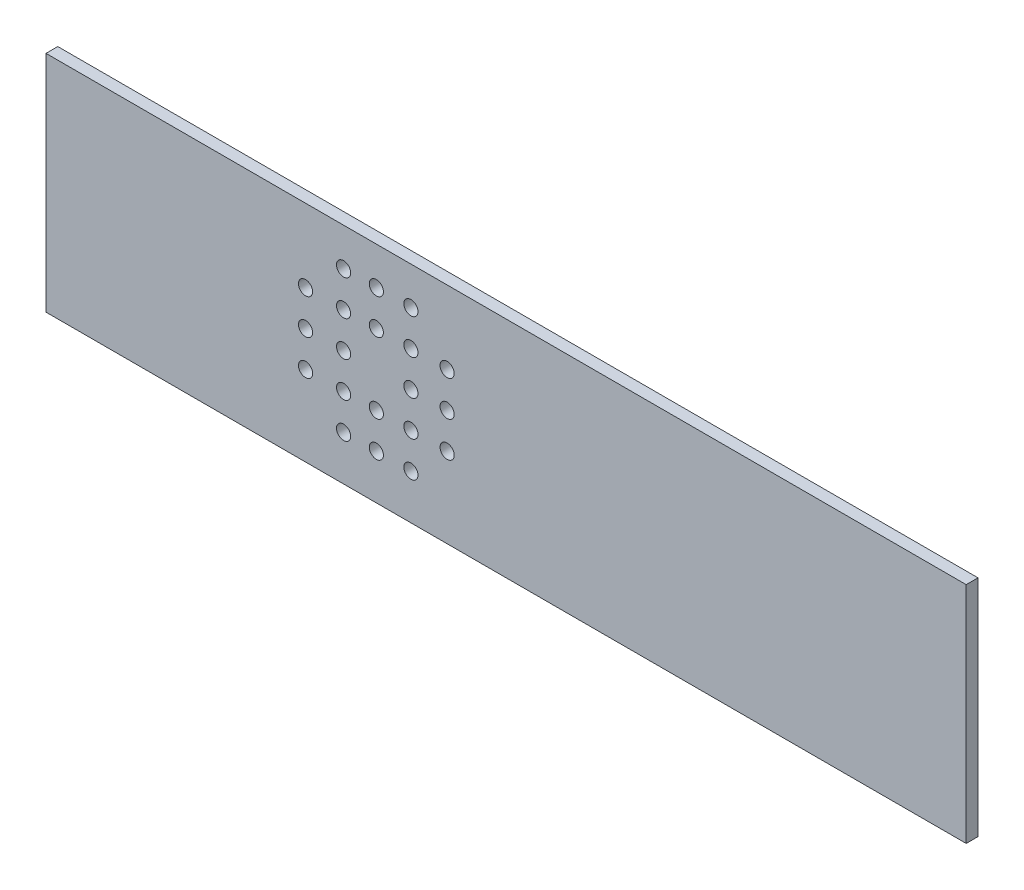
ISO-10303-21;
HEADER;
FILE_DESCRIPTION(('STEP AP214'),'2;1');
FILE_NAME('part.step','',(''),(''),'','','');
FILE_SCHEMA(('AUTOMOTIVE_DESIGN { 1 0 10303 214 1 1 1 1 }'));
ENDSEC;
DATA;
#1=APPLICATION_CONTEXT('core data for automotive mechanical design processes');
#2=APPLICATION_PROTOCOL_DEFINITION('international standard','automotive_design',2000,#1);
#3=PRODUCT_CONTEXT('',#1,'mechanical');
#4=PRODUCT('Part','Part','',(#3));
#5=PRODUCT_RELATED_PRODUCT_CATEGORY('part','',(#4));
#6=PRODUCT_DEFINITION_FORMATION('','',#4);
#7=PRODUCT_DEFINITION_CONTEXT('part definition',#1,'design');
#8=PRODUCT_DEFINITION('design','',#6,#7);
#9=PRODUCT_DEFINITION_SHAPE('','',#8);
#10=(LENGTH_UNIT() NAMED_UNIT(*) SI_UNIT(.MILLI.,.METRE.));
#11=(NAMED_UNIT(*) PLANE_ANGLE_UNIT() SI_UNIT($,.RADIAN.));
#12=(NAMED_UNIT(*) SI_UNIT($,.STERADIAN.) SOLID_ANGLE_UNIT());
#13=UNCERTAINTY_MEASURE_WITH_UNIT(LENGTH_MEASURE(1.E-05),#10,'distance_accuracy_value','');
#14=(GEOMETRIC_REPRESENTATION_CONTEXT(3) GLOBAL_UNCERTAINTY_ASSIGNED_CONTEXT((#13)) GLOBAL_UNIT_ASSIGNED_CONTEXT((#10,
#11,#12)) REPRESENTATION_CONTEXT('',''));
#15=CARTESIAN_POINT('',(0.,0.,0.));
#16=DIRECTION('',(0.,0.,1.));
#17=DIRECTION('',(1.,0.,0.));
#18=AXIS2_PLACEMENT_3D('',#15,#16,#17);
#19=CARTESIAN_POINT('',(0.,0.,5.));
#20=DIRECTION('',(0.,0.,1.));
#21=DIRECTION('',(1.,0.,0.));
#22=AXIS2_PLACEMENT_3D('',#19,#20,#21);
#23=PLANE('',#22);
#24=CARTESIAN_POINT('',(92.1890894196573,-22.2407910927372,5.));
#25=DIRECTION('',(0.,0.,1.));
#26=DIRECTION('',(1.,0.,0.));
#27=AXIS2_PLACEMENT_3D('',#24,#25,#26);
#28=CIRCLE('',#27,2.99999999999999);
#29=CARTESIAN_POINT('',(95.1890894196573,-22.2407910927372,5.));
#30=VERTEX_POINT('',#29);
#31=EDGE_CURVE('E217',#30,#30,#28,.T.);
#32=ORIENTED_EDGE('',*,*,#31,.F.);
#33=EDGE_LOOP('',(#32));
#34=FACE_BOUND('',#33,.T.);
#35=CARTESIAN_POINT('',(108.306752513581,-67.2407910927372,5.));
#36=DIRECTION('',(0.,0.,1.));
#37=DIRECTION('',(1.,0.,0.));
#38=AXIS2_PLACEMENT_3D('',#35,#36,#37);
#39=CIRCLE('',#38,2.99999999999999);
#40=CARTESIAN_POINT('',(111.306752513581,-67.2407910927372,5.));
#41=VERTEX_POINT('',#40);
#42=EDGE_CURVE('E205',#41,#41,#39,.T.);
#43=ORIENTED_EDGE('',*,*,#42,.F.);
#44=EDGE_LOOP('',(#43));
#45=FACE_BOUND('',#44,.T.);
#46=CARTESIAN_POINT('',(152.189089419657,-52.2407910927372,5.));
#47=DIRECTION('',(0.,0.,1.));
#48=DIRECTION('',(1.,0.,0.));
#49=AXIS2_PLACEMENT_3D('',#46,#47,#48);
#50=CIRCLE('',#49,2.99999999999999);
#51=CARTESIAN_POINT('',(155.189089419657,-52.2407910927372,5.));
#52=VERTEX_POINT('',#51);
#53=EDGE_CURVE('E193',#52,#52,#50,.T.);
#54=ORIENTED_EDGE('',*,*,#53,.F.);
#55=EDGE_LOOP('',(#54));
#56=FACE_BOUND('',#55,.T.);
#57=CARTESIAN_POINT('',(152.189089419657,-22.2407910927372,5.));
#58=DIRECTION('',(0.,0.,1.));
#59=DIRECTION('',(1.,0.,0.));
#60=AXIS2_PLACEMENT_3D('',#57,#58,#59);
#61=CIRCLE('',#60,2.99999999999999);
#62=CARTESIAN_POINT('',(155.189089419657,-22.2407910927372,5.));
#63=VERTEX_POINT('',#62);
#64=EDGE_CURVE('E181',#63,#63,#61,.T.);
#65=ORIENTED_EDGE('',*,*,#64,.F.);
#66=EDGE_LOOP('',(#65));
#67=FACE_BOUND('',#66,.T.);
#68=CARTESIAN_POINT('',(136.844623790647,-22.2407910927372,5.));
#69=DIRECTION('',(0.,0.,1.));
#70=DIRECTION('',(1.,0.,0.));
#71=AXIS2_PLACEMENT_3D('',#68,#69,#70);
#72=CIRCLE('',#71,2.99999999999999);
#73=CARTESIAN_POINT('',(139.844623790647,-22.2407910927372,5.));
#74=VERTEX_POINT('',#73);
#75=EDGE_CURVE('E169',#74,#74,#72,.T.);
#76=ORIENTED_EDGE('',*,*,#75,.F.);
#77=EDGE_LOOP('',(#76));
#78=FACE_BOUND('',#77,.T.);
#79=CARTESIAN_POINT('',(136.844623790647,-52.2407910927372,5.));
#80=DIRECTION('',(0.,0.,1.));
#81=DIRECTION('',(1.,0.,0.));
#82=AXIS2_PLACEMENT_3D('',#79,#80,#81);
#83=CIRCLE('',#82,2.99999999999999);
#84=CARTESIAN_POINT('',(139.844623790647,-52.2407910927372,5.));
#85=VERTEX_POINT('',#84);
#86=EDGE_CURVE('E157',#85,#85,#83,.T.);
#87=ORIENTED_EDGE('',*,*,#86,.F.);
#88=EDGE_LOOP('',(#87));
#89=FACE_BOUND('',#88,.T.);
#90=CARTESIAN_POINT('',(136.844623790647,-37.2407910927372,5.));
#91=DIRECTION('',(0.,0.,1.));
#92=DIRECTION('',(1.,0.,0.));
#93=AXIS2_PLACEMENT_3D('',#90,#91,#92);
#94=CIRCLE('',#93,2.99999999999999);
#95=CARTESIAN_POINT('',(139.844623790647,-37.2407910927372,5.));
#96=VERTEX_POINT('',#95);
#97=EDGE_CURVE('E145',#96,#96,#94,.T.);
#98=ORIENTED_EDGE('',*,*,#97,.F.);
#99=EDGE_LOOP('',(#98));
#100=FACE_BOUND('',#99,.T.);
#101=CARTESIAN_POINT('',(122.189089419657,-67.2407910927372,5.));
#102=DIRECTION('',(0.,0.,1.));
#103=DIRECTION('',(1.,0.,0.));
#104=AXIS2_PLACEMENT_3D('',#101,#102,#103);
#105=CIRCLE('',#104,2.99999999999999);
#106=CARTESIAN_POINT('',(125.189089419657,-67.2407910927372,5.));
#107=VERTEX_POINT('',#106);
#108=EDGE_CURVE('E133',#107,#107,#105,.T.);
#109=ORIENTED_EDGE('',*,*,#108,.F.);
#110=EDGE_LOOP('',(#109));
#111=FACE_BOUND('',#110,.T.);
#112=CARTESIAN_POINT('',(108.306752513581,-37.2407910927372,5.));
#113=DIRECTION('',(0.,0.,1.));
#114=DIRECTION('',(1.,0.,0.));
#115=AXIS2_PLACEMENT_3D('',#112,#113,#114);
#116=CIRCLE('',#115,3.00000000000001);
#117=CARTESIAN_POINT('',(111.306752513581,-37.2407910927372,5.));
#118=VERTEX_POINT('',#117);
#119=EDGE_CURVE('E121',#118,#118,#116,.T.);
#120=ORIENTED_EDGE('',*,*,#119,.F.);
#121=EDGE_LOOP('',(#120));
#122=FACE_BOUND('',#121,.T.);
#123=CARTESIAN_POINT('',(92.1890894196573,-37.2407910927372,5.));
#124=DIRECTION('',(0.,0.,1.));
#125=DIRECTION('',(1.,0.,0.));
#126=AXIS2_PLACEMENT_3D('',#123,#124,#125);
#127=CIRCLE('',#126,3.00000000000001);
#128=CARTESIAN_POINT('',(95.1890894196573,-37.2407910927372,5.));
#129=VERTEX_POINT('',#128);
#130=EDGE_CURVE('E100',#129,#129,#127,.T.);
#131=ORIENTED_EDGE('',*,*,#130,.F.);
#132=EDGE_LOOP('',(#131));
#133=FACE_BOUND('',#132,.T.);
#134=DIRECTION('',(0.,-1.,0.));
#135=VECTOR('',#134,1.);
#136=CARTESIAN_POINT('',(-17.8109105803427,8.77698574338086,5.));
#137=LINE('',#136,#135);
#138=CARTESIAN_POINT('',(-17.8109105803427,8.77698574338086,5.));
#139=VERTEX_POINT('',#138);
#140=CARTESIAN_POINT('',(-17.8109105803427,-86.2230142566191,5.));
#141=VERTEX_POINT('',#140);
#142=EDGE_CURVE('E85',#139,#141,#137,.T.);
#143=ORIENTED_EDGE('',*,*,#142,.T.);
#144=DIRECTION('',(1.,0.,0.));
#145=VECTOR('',#144,1.);
#146=CARTESIAN_POINT('',(-17.8109105803427,-86.2230142566191,5.));
#147=LINE('',#146,#145);
#148=CARTESIAN_POINT('',(372.189089419657,-86.2230142566191,5.));
#149=VERTEX_POINT('',#148);
#150=EDGE_CURVE('E80',#141,#149,#147,.T.);
#151=ORIENTED_EDGE('',*,*,#150,.T.);
#152=DIRECTION('',(0.,1.,0.));
#153=VECTOR('',#152,1.);
#154=CARTESIAN_POINT('',(372.189089419657,8.77698574338086,5.));
#155=LINE('',#154,#153);
#156=CARTESIAN_POINT('',(372.189089419657,8.77698574338086,5.));
#157=VERTEX_POINT('',#156);
#158=EDGE_CURVE('E83',#149,#157,#155,.T.);
#159=ORIENTED_EDGE('',*,*,#158,.T.);
#160=DIRECTION('',(-1.,0.,0.));
#161=VECTOR('',#160,1.);
#162=CARTESIAN_POINT('',(-17.8109105803427,8.77698574338086,5.));
#163=LINE('',#162,#161);
#164=EDGE_CURVE('E50',#157,#139,#163,.T.);
#165=ORIENTED_EDGE('',*,*,#164,.T.);
#166=EDGE_LOOP('',(#143,#151,#159,#165));
#167=FACE_BOUND('',#166,.T.);
#168=CARTESIAN_POINT('',(152.189089419657,-37.2407910927372,5.));
#169=DIRECTION('',(0.,0.,1.));
#170=DIRECTION('',(1.,0.,0.));
#171=AXIS2_PLACEMENT_3D('',#168,#169,#170);
#172=CIRCLE('',#171,2.99999999999999);
#173=CARTESIAN_POINT('',(155.189089419657,-37.2407910927372,5.));
#174=VERTEX_POINT('',#173);
#175=EDGE_CURVE('E115',#174,#174,#172,.T.);
#176=ORIENTED_EDGE('',*,*,#175,.F.);
#177=EDGE_LOOP('',(#176));
#178=FACE_BOUND('',#177,.T.);
#179=CARTESIAN_POINT('',(122.189089419657,-7.24079109273723,5.));
#180=DIRECTION('',(0.,0.,1.));
#181=DIRECTION('',(1.,0.,0.));
#182=AXIS2_PLACEMENT_3D('',#179,#180,#181);
#183=CIRCLE('',#182,2.99999999999999);
#184=CARTESIAN_POINT('',(125.189089419657,-7.24079109273723,5.));
#185=VERTEX_POINT('',#184);
#186=EDGE_CURVE('E127',#185,#185,#183,.T.);
#187=ORIENTED_EDGE('',*,*,#186,.F.);
#188=EDGE_LOOP('',(#187));
#189=FACE_BOUND('',#188,.T.);
#190=CARTESIAN_POINT('',(122.189089419657,-52.2407910927372,5.));
#191=DIRECTION('',(0.,0.,1.));
#192=DIRECTION('',(1.,0.,0.));
#193=AXIS2_PLACEMENT_3D('',#190,#191,#192);
#194=CIRCLE('',#193,2.99999999999997);
#195=CARTESIAN_POINT('',(125.189089419657,-52.2407910927372,5.));
#196=VERTEX_POINT('',#195);
#197=EDGE_CURVE('E139',#196,#196,#194,.T.);
#198=ORIENTED_EDGE('',*,*,#197,.F.);
#199=EDGE_LOOP('',(#198));
#200=FACE_BOUND('',#199,.T.);
#201=CARTESIAN_POINT('',(122.189089419657,-22.2407910927372,5.));
#202=DIRECTION('',(0.,0.,1.));
#203=DIRECTION('',(1.,0.,0.));
#204=AXIS2_PLACEMENT_3D('',#201,#202,#203);
#205=CIRCLE('',#204,2.99999999999999);
#206=CARTESIAN_POINT('',(125.189089419657,-22.2407910927372,5.));
#207=VERTEX_POINT('',#206);
#208=EDGE_CURVE('E151',#207,#207,#205,.T.);
#209=ORIENTED_EDGE('',*,*,#208,.F.);
#210=EDGE_LOOP('',(#209));
#211=FACE_BOUND('',#210,.T.);
#212=CARTESIAN_POINT('',(108.306752513581,-52.2407910927372,5.));
#213=DIRECTION('',(0.,0.,1.));
#214=DIRECTION('',(1.,0.,0.));
#215=AXIS2_PLACEMENT_3D('',#212,#213,#214);
#216=CIRCLE('',#215,2.99999999999999);
#217=CARTESIAN_POINT('',(111.306752513581,-52.2407910927372,5.));
#218=VERTEX_POINT('',#217);
#219=EDGE_CURVE('E163',#218,#218,#216,.T.);
#220=ORIENTED_EDGE('',*,*,#219,.F.);
#221=EDGE_LOOP('',(#220));
#222=FACE_BOUND('',#221,.T.);
#223=CARTESIAN_POINT('',(108.306752513581,-22.2407910927372,5.));
#224=DIRECTION('',(0.,0.,1.));
#225=DIRECTION('',(1.,0.,0.));
#226=AXIS2_PLACEMENT_3D('',#223,#224,#225);
#227=CIRCLE('',#226,2.99999999999999);
#228=CARTESIAN_POINT('',(111.306752513581,-22.2407910927372,5.));
#229=VERTEX_POINT('',#228);
#230=EDGE_CURVE('E175',#229,#229,#227,.T.);
#231=ORIENTED_EDGE('',*,*,#230,.F.);
#232=EDGE_LOOP('',(#231));
#233=FACE_BOUND('',#232,.T.);
#234=CARTESIAN_POINT('',(136.844623790647,-7.24079109273723,5.));
#235=DIRECTION('',(0.,0.,1.));
#236=DIRECTION('',(1.,0.,0.));
#237=AXIS2_PLACEMENT_3D('',#234,#235,#236);
#238=CIRCLE('',#237,2.99999999999999);
#239=CARTESIAN_POINT('',(139.844623790647,-7.24079109273723,5.));
#240=VERTEX_POINT('',#239);
#241=EDGE_CURVE('E187',#240,#240,#238,.T.);
#242=ORIENTED_EDGE('',*,*,#241,.F.);
#243=EDGE_LOOP('',(#242));
#244=FACE_BOUND('',#243,.T.);
#245=CARTESIAN_POINT('',(136.844623790647,-67.2407910927372,5.));
#246=DIRECTION('',(0.,0.,1.));
#247=DIRECTION('',(1.,0.,0.));
#248=AXIS2_PLACEMENT_3D('',#245,#246,#247);
#249=CIRCLE('',#248,2.99999999999999);
#250=CARTESIAN_POINT('',(139.844623790647,-67.2407910927372,5.));
#251=VERTEX_POINT('',#250);
#252=EDGE_CURVE('E199',#251,#251,#249,.T.);
#253=ORIENTED_EDGE('',*,*,#252,.F.);
#254=EDGE_LOOP('',(#253));
#255=FACE_BOUND('',#254,.T.);
#256=CARTESIAN_POINT('',(92.1890894196573,-52.2407910927372,5.));
#257=DIRECTION('',(0.,0.,1.));
#258=DIRECTION('',(1.,0.,0.));
#259=AXIS2_PLACEMENT_3D('',#256,#257,#258);
#260=CIRCLE('',#259,2.99999999999999);
#261=CARTESIAN_POINT('',(95.1890894196573,-52.2407910927372,5.));
#262=VERTEX_POINT('',#261);
#263=EDGE_CURVE('E211',#262,#262,#260,.T.);
#264=ORIENTED_EDGE('',*,*,#263,.F.);
#265=EDGE_LOOP('',(#264));
#266=FACE_BOUND('',#265,.T.);
#267=CARTESIAN_POINT('',(108.306752513581,-7.24079109273723,5.));
#268=DIRECTION('',(0.,0.,1.));
#269=DIRECTION('',(1.,0.,0.));
#270=AXIS2_PLACEMENT_3D('',#267,#268,#269);
#271=CIRCLE('',#270,2.99999999999999);
#272=CARTESIAN_POINT('',(111.306752513581,-7.24079109273723,5.));
#273=VERTEX_POINT('',#272);
#274=EDGE_CURVE('E223',#273,#273,#271,.T.);
#275=ORIENTED_EDGE('',*,*,#274,.F.);
#276=EDGE_LOOP('',(#275));
#277=FACE_BOUND('',#276,.T.);
#278=ADVANCED_FACE('F33',(#34,#45,#56,#67,#78,#89,#100,#111,#122,#133,#167,#178,#189,#200,#211,
#222,#233,#244,#255,#266,#277),#23,.T.);
#279=CARTESIAN_POINT('',(0.,0.,0.));
#280=DIRECTION('',(0.,0.,1.));
#281=DIRECTION('',(1.,0.,0.));
#282=AXIS2_PLACEMENT_3D('',#279,#280,#281);
#283=PLANE('',#282);
#284=DIRECTION('',(0.,-1.,0.));
#285=VECTOR('',#284,1.);
#286=CARTESIAN_POINT('',(-17.8109105803427,8.77698574338086,0.));
#287=LINE('',#286,#285);
#288=CARTESIAN_POINT('',(-17.8109105803427,8.77698574338086,0.));
#289=VERTEX_POINT('',#288);
#290=CARTESIAN_POINT('',(-17.8109105803427,-86.2230142566191,0.));
#291=VERTEX_POINT('',#290);
#292=EDGE_CURVE('E97',#289,#291,#287,.T.);
#293=ORIENTED_EDGE('',*,*,#292,.F.);
#294=DIRECTION('',(-1.,0.,0.));
#295=VECTOR('',#294,1.);
#296=CARTESIAN_POINT('',(-17.8109105803427,8.77698574338086,0.));
#297=LINE('',#296,#295);
#298=CARTESIAN_POINT('',(372.189089419657,8.77698574338086,0.));
#299=VERTEX_POINT('',#298);
#300=EDGE_CURVE('E73',#299,#289,#297,.T.);
#301=ORIENTED_EDGE('',*,*,#300,.F.);
#302=DIRECTION('',(0.,1.,0.));
#303=VECTOR('',#302,1.);
#304=CARTESIAN_POINT('',(372.189089419657,8.77698574338086,0.));
#305=LINE('',#304,#303);
#306=CARTESIAN_POINT('',(372.189089419657,-86.2230142566191,0.));
#307=VERTEX_POINT('',#306);
#308=EDGE_CURVE('E67',#307,#299,#305,.T.);
#309=ORIENTED_EDGE('',*,*,#308,.F.);
#310=DIRECTION('',(1.,0.,0.));
#311=VECTOR('',#310,1.);
#312=CARTESIAN_POINT('',(-17.8109105803427,-86.2230142566191,0.));
#313=LINE('',#312,#311);
#314=EDGE_CURVE('E89',#291,#307,#313,.T.);
#315=ORIENTED_EDGE('',*,*,#314,.F.);
#316=EDGE_LOOP('',(#293,#301,#309,#315));
#317=FACE_BOUND('',#316,.T.);
#318=CARTESIAN_POINT('',(92.1890894196573,-37.2407910927372,0.));
#319=DIRECTION('',(0.,0.,1.));
#320=DIRECTION('',(1.,0.,0.));
#321=AXIS2_PLACEMENT_3D('',#318,#319,#320);
#322=CIRCLE('',#321,3.00000000000001);
#323=CARTESIAN_POINT('',(95.1890894196573,-37.2407910927372,0.));
#324=VERTEX_POINT('',#323);
#325=EDGE_CURVE('E112',#324,#324,#322,.T.);
#326=ORIENTED_EDGE('',*,*,#325,.T.);
#327=EDGE_LOOP('',(#326));
#328=FACE_BOUND('',#327,.T.);
#329=CARTESIAN_POINT('',(152.189089419657,-37.2407910927372,0.));
#330=DIRECTION('',(0.,0.,1.));
#331=DIRECTION('',(1.,0.,0.));
#332=AXIS2_PLACEMENT_3D('',#329,#330,#331);
#333=CIRCLE('',#332,2.99999999999999);
#334=CARTESIAN_POINT('',(155.189089419657,-37.2407910927372,0.));
#335=VERTEX_POINT('',#334);
#336=EDGE_CURVE('E118',#335,#335,#333,.T.);
#337=ORIENTED_EDGE('',*,*,#336,.T.);
#338=EDGE_LOOP('',(#337));
#339=FACE_BOUND('',#338,.T.);
#340=CARTESIAN_POINT('',(108.306752513581,-37.2407910927372,0.));
#341=DIRECTION('',(0.,0.,1.));
#342=DIRECTION('',(1.,0.,0.));
#343=AXIS2_PLACEMENT_3D('',#340,#341,#342);
#344=CIRCLE('',#343,3.00000000000001);
#345=CARTESIAN_POINT('',(111.306752513581,-37.2407910927372,0.));
#346=VERTEX_POINT('',#345);
#347=EDGE_CURVE('E124',#346,#346,#344,.T.);
#348=ORIENTED_EDGE('',*,*,#347,.T.);
#349=EDGE_LOOP('',(#348));
#350=FACE_BOUND('',#349,.T.);
#351=CARTESIAN_POINT('',(122.189089419657,-7.24079109273723,0.));
#352=DIRECTION('',(0.,0.,1.));
#353=DIRECTION('',(1.,0.,0.));
#354=AXIS2_PLACEMENT_3D('',#351,#352,#353);
#355=CIRCLE('',#354,2.99999999999999);
#356=CARTESIAN_POINT('',(125.189089419657,-7.24079109273723,0.));
#357=VERTEX_POINT('',#356);
#358=EDGE_CURVE('E130',#357,#357,#355,.T.);
#359=ORIENTED_EDGE('',*,*,#358,.T.);
#360=EDGE_LOOP('',(#359));
#361=FACE_BOUND('',#360,.T.);
#362=CARTESIAN_POINT('',(122.189089419657,-67.2407910927372,0.));
#363=DIRECTION('',(0.,0.,1.));
#364=DIRECTION('',(1.,0.,0.));
#365=AXIS2_PLACEMENT_3D('',#362,#363,#364);
#366=CIRCLE('',#365,2.99999999999999);
#367=CARTESIAN_POINT('',(125.189089419657,-67.2407910927372,0.));
#368=VERTEX_POINT('',#367);
#369=EDGE_CURVE('E136',#368,#368,#366,.T.);
#370=ORIENTED_EDGE('',*,*,#369,.T.);
#371=EDGE_LOOP('',(#370));
#372=FACE_BOUND('',#371,.T.);
#373=CARTESIAN_POINT('',(122.189089419657,-52.2407910927372,0.));
#374=DIRECTION('',(0.,0.,1.));
#375=DIRECTION('',(1.,0.,0.));
#376=AXIS2_PLACEMENT_3D('',#373,#374,#375);
#377=CIRCLE('',#376,2.99999999999997);
#378=CARTESIAN_POINT('',(125.189089419657,-52.2407910927372,0.));
#379=VERTEX_POINT('',#378);
#380=EDGE_CURVE('E142',#379,#379,#377,.T.);
#381=ORIENTED_EDGE('',*,*,#380,.T.);
#382=EDGE_LOOP('',(#381));
#383=FACE_BOUND('',#382,.T.);
#384=CARTESIAN_POINT('',(136.844623790647,-37.2407910927372,0.));
#385=DIRECTION('',(0.,0.,1.));
#386=DIRECTION('',(1.,0.,0.));
#387=AXIS2_PLACEMENT_3D('',#384,#385,#386);
#388=CIRCLE('',#387,2.99999999999999);
#389=CARTESIAN_POINT('',(139.844623790647,-37.2407910927372,0.));
#390=VERTEX_POINT('',#389);
#391=EDGE_CURVE('E148',#390,#390,#388,.T.);
#392=ORIENTED_EDGE('',*,*,#391,.T.);
#393=EDGE_LOOP('',(#392));
#394=FACE_BOUND('',#393,.T.);
#395=CARTESIAN_POINT('',(122.189089419657,-22.2407910927372,0.));
#396=DIRECTION('',(0.,0.,1.));
#397=DIRECTION('',(1.,0.,0.));
#398=AXIS2_PLACEMENT_3D('',#395,#396,#397);
#399=CIRCLE('',#398,2.99999999999999);
#400=CARTESIAN_POINT('',(125.189089419657,-22.2407910927372,0.));
#401=VERTEX_POINT('',#400);
#402=EDGE_CURVE('E154',#401,#401,#399,.T.);
#403=ORIENTED_EDGE('',*,*,#402,.T.);
#404=EDGE_LOOP('',(#403));
#405=FACE_BOUND('',#404,.T.);
#406=CARTESIAN_POINT('',(136.844623790647,-52.2407910927372,0.));
#407=DIRECTION('',(0.,0.,1.));
#408=DIRECTION('',(1.,0.,0.));
#409=AXIS2_PLACEMENT_3D('',#406,#407,#408);
#410=CIRCLE('',#409,2.99999999999999);
#411=CARTESIAN_POINT('',(139.844623790647,-52.2407910927372,0.));
#412=VERTEX_POINT('',#411);
#413=EDGE_CURVE('E160',#412,#412,#410,.T.);
#414=ORIENTED_EDGE('',*,*,#413,.T.);
#415=EDGE_LOOP('',(#414));
#416=FACE_BOUND('',#415,.T.);
#417=CARTESIAN_POINT('',(108.306752513581,-52.2407910927372,0.));
#418=DIRECTION('',(0.,0.,1.));
#419=DIRECTION('',(1.,0.,0.));
#420=AXIS2_PLACEMENT_3D('',#417,#418,#419);
#421=CIRCLE('',#420,2.99999999999999);
#422=CARTESIAN_POINT('',(111.306752513581,-52.2407910927372,0.));
#423=VERTEX_POINT('',#422);
#424=EDGE_CURVE('E166',#423,#423,#421,.T.);
#425=ORIENTED_EDGE('',*,*,#424,.T.);
#426=EDGE_LOOP('',(#425));
#427=FACE_BOUND('',#426,.T.);
#428=CARTESIAN_POINT('',(136.844623790647,-22.2407910927372,0.));
#429=DIRECTION('',(0.,0.,1.));
#430=DIRECTION('',(1.,0.,0.));
#431=AXIS2_PLACEMENT_3D('',#428,#429,#430);
#432=CIRCLE('',#431,2.99999999999999);
#433=CARTESIAN_POINT('',(139.844623790647,-22.2407910927372,0.));
#434=VERTEX_POINT('',#433);
#435=EDGE_CURVE('E172',#434,#434,#432,.T.);
#436=ORIENTED_EDGE('',*,*,#435,.T.);
#437=EDGE_LOOP('',(#436));
#438=FACE_BOUND('',#437,.T.);
#439=CARTESIAN_POINT('',(108.306752513581,-22.2407910927372,0.));
#440=DIRECTION('',(0.,0.,1.));
#441=DIRECTION('',(1.,0.,0.));
#442=AXIS2_PLACEMENT_3D('',#439,#440,#441);
#443=CIRCLE('',#442,2.99999999999999);
#444=CARTESIAN_POINT('',(111.306752513581,-22.2407910927372,0.));
#445=VERTEX_POINT('',#444);
#446=EDGE_CURVE('E178',#445,#445,#443,.T.);
#447=ORIENTED_EDGE('',*,*,#446,.T.);
#448=EDGE_LOOP('',(#447));
#449=FACE_BOUND('',#448,.T.);
#450=CARTESIAN_POINT('',(152.189089419657,-22.2407910927372,0.));
#451=DIRECTION('',(0.,0.,1.));
#452=DIRECTION('',(1.,0.,0.));
#453=AXIS2_PLACEMENT_3D('',#450,#451,#452);
#454=CIRCLE('',#453,2.99999999999999);
#455=CARTESIAN_POINT('',(155.189089419657,-22.2407910927372,0.));
#456=VERTEX_POINT('',#455);
#457=EDGE_CURVE('E184',#456,#456,#454,.T.);
#458=ORIENTED_EDGE('',*,*,#457,.T.);
#459=EDGE_LOOP('',(#458));
#460=FACE_BOUND('',#459,.T.);
#461=CARTESIAN_POINT('',(136.844623790647,-7.24079109273723,0.));
#462=DIRECTION('',(0.,0.,1.));
#463=DIRECTION('',(1.,0.,0.));
#464=AXIS2_PLACEMENT_3D('',#461,#462,#463);
#465=CIRCLE('',#464,2.99999999999999);
#466=CARTESIAN_POINT('',(139.844623790647,-7.24079109273723,0.));
#467=VERTEX_POINT('',#466);
#468=EDGE_CURVE('E190',#467,#467,#465,.T.);
#469=ORIENTED_EDGE('',*,*,#468,.T.);
#470=EDGE_LOOP('',(#469));
#471=FACE_BOUND('',#470,.T.);
#472=CARTESIAN_POINT('',(152.189089419657,-52.2407910927372,0.));
#473=DIRECTION('',(0.,0.,1.));
#474=DIRECTION('',(1.,0.,0.));
#475=AXIS2_PLACEMENT_3D('',#472,#473,#474);
#476=CIRCLE('',#475,2.99999999999999);
#477=CARTESIAN_POINT('',(155.189089419657,-52.2407910927372,0.));
#478=VERTEX_POINT('',#477);
#479=EDGE_CURVE('E196',#478,#478,#476,.T.);
#480=ORIENTED_EDGE('',*,*,#479,.T.);
#481=EDGE_LOOP('',(#480));
#482=FACE_BOUND('',#481,.T.);
#483=CARTESIAN_POINT('',(136.844623790647,-67.2407910927372,0.));
#484=DIRECTION('',(0.,0.,1.));
#485=DIRECTION('',(1.,0.,0.));
#486=AXIS2_PLACEMENT_3D('',#483,#484,#485);
#487=CIRCLE('',#486,2.99999999999999);
#488=CARTESIAN_POINT('',(139.844623790647,-67.2407910927372,0.));
#489=VERTEX_POINT('',#488);
#490=EDGE_CURVE('E202',#489,#489,#487,.T.);
#491=ORIENTED_EDGE('',*,*,#490,.T.);
#492=EDGE_LOOP('',(#491));
#493=FACE_BOUND('',#492,.T.);
#494=CARTESIAN_POINT('',(108.306752513581,-67.2407910927372,0.));
#495=DIRECTION('',(0.,0.,1.));
#496=DIRECTION('',(1.,0.,0.));
#497=AXIS2_PLACEMENT_3D('',#494,#495,#496);
#498=CIRCLE('',#497,2.99999999999999);
#499=CARTESIAN_POINT('',(111.306752513581,-67.2407910927372,0.));
#500=VERTEX_POINT('',#499);
#501=EDGE_CURVE('E208',#500,#500,#498,.T.);
#502=ORIENTED_EDGE('',*,*,#501,.T.);
#503=EDGE_LOOP('',(#502));
#504=FACE_BOUND('',#503,.T.);
#505=CARTESIAN_POINT('',(92.1890894196573,-52.2407910927372,0.));
#506=DIRECTION('',(0.,0.,1.));
#507=DIRECTION('',(1.,0.,0.));
#508=AXIS2_PLACEMENT_3D('',#505,#506,#507);
#509=CIRCLE('',#508,2.99999999999999);
#510=CARTESIAN_POINT('',(95.1890894196573,-52.2407910927372,0.));
#511=VERTEX_POINT('',#510);
#512=EDGE_CURVE('E214',#511,#511,#509,.T.);
#513=ORIENTED_EDGE('',*,*,#512,.T.);
#514=EDGE_LOOP('',(#513));
#515=FACE_BOUND('',#514,.T.);
#516=CARTESIAN_POINT('',(92.1890894196573,-22.2407910927372,0.));
#517=DIRECTION('',(0.,0.,1.));
#518=DIRECTION('',(1.,0.,0.));
#519=AXIS2_PLACEMENT_3D('',#516,#517,#518);
#520=CIRCLE('',#519,2.99999999999999);
#521=CARTESIAN_POINT('',(95.1890894196573,-22.2407910927372,0.));
#522=VERTEX_POINT('',#521);
#523=EDGE_CURVE('E220',#522,#522,#520,.T.);
#524=ORIENTED_EDGE('',*,*,#523,.T.);
#525=EDGE_LOOP('',(#524));
#526=FACE_BOUND('',#525,.T.);
#527=CARTESIAN_POINT('',(108.306752513581,-7.24079109273723,0.));
#528=DIRECTION('',(0.,0.,1.));
#529=DIRECTION('',(1.,0.,0.));
#530=AXIS2_PLACEMENT_3D('',#527,#528,#529);
#531=CIRCLE('',#530,2.99999999999999);
#532=CARTESIAN_POINT('',(111.306752513581,-7.24079109273723,0.));
#533=VERTEX_POINT('',#532);
#534=EDGE_CURVE('E226',#533,#533,#531,.T.);
#535=ORIENTED_EDGE('',*,*,#534,.T.);
#536=EDGE_LOOP('',(#535));
#537=FACE_BOUND('',#536,.T.);
#538=ADVANCED_FACE('F108',(#317,#328,#339,#350,#361,#372,#383,#394,#405,#416,#427,#438,#449,
#460,#471,#482,#493,#504,#515,#526,#537),#283,.F.);
#539=CARTESIAN_POINT('',(-17.8109105803427,8.77698574338086,5.));
#540=DIRECTION('',(1.,0.,0.));
#541=DIRECTION('',(0.,1.,0.));
#542=AXIS2_PLACEMENT_3D('',#539,#540,#541);
#543=PLANE('',#542);
#544=ORIENTED_EDGE('',*,*,#292,.T.);
#545=DIRECTION('',(0.,0.,-1.));
#546=VECTOR('',#545,1.);
#547=CARTESIAN_POINT('',(-17.8109105803427,-86.2230142566191,5.));
#548=LINE('',#547,#546);
#549=EDGE_CURVE('E11',#141,#291,#548,.T.);
#550=ORIENTED_EDGE('',*,*,#549,.F.);
#551=ORIENTED_EDGE('',*,*,#142,.F.);
#552=DIRECTION('',(0.,0.,-1.));
#553=VECTOR('',#552,1.);
#554=CARTESIAN_POINT('',(-17.8109105803427,8.77698574338086,5.));
#555=LINE('',#554,#553);
#556=EDGE_CURVE('E93',#139,#289,#555,.T.);
#557=ORIENTED_EDGE('',*,*,#556,.T.);
#558=EDGE_LOOP('',(#544,#550,#551,#557));
#559=FACE_BOUND('',#558,.T.);
#560=ADVANCED_FACE('F35',(#559),#543,.F.);
#561=CARTESIAN_POINT('',(-17.8109105803427,-86.2230142566191,5.));
#562=DIRECTION('',(0.,1.,0.));
#563=DIRECTION('',(0.,0.,1.));
#564=AXIS2_PLACEMENT_3D('',#561,#562,#563);
#565=PLANE('',#564);
#566=ORIENTED_EDGE('',*,*,#314,.T.);
#567=DIRECTION('',(0.,0.,-1.));
#568=VECTOR('',#567,1.);
#569=CARTESIAN_POINT('',(372.189089419657,-86.2230142566191,5.));
#570=LINE('',#569,#568);
#571=EDGE_CURVE('E42',#149,#307,#570,.T.);
#572=ORIENTED_EDGE('',*,*,#571,.F.);
#573=ORIENTED_EDGE('',*,*,#150,.F.);
#574=ORIENTED_EDGE('',*,*,#549,.T.);
#575=EDGE_LOOP('',(#566,#572,#573,#574));
#576=FACE_BOUND('',#575,.T.);
#577=ADVANCED_FACE('F88',(#576),#565,.F.);
#578=CARTESIAN_POINT('',(372.189089419657,8.77698574338086,5.));
#579=DIRECTION('',(-1.,0.,0.));
#580=DIRECTION('',(0.,0.,1.));
#581=AXIS2_PLACEMENT_3D('',#578,#579,#580);
#582=PLANE('',#581);
#583=ORIENTED_EDGE('',*,*,#308,.T.);
#584=DIRECTION('',(0.,0.,-1.));
#585=VECTOR('',#584,1.);
#586=CARTESIAN_POINT('',(372.189089419657,8.77698574338086,5.));
#587=LINE('',#586,#585);
#588=EDGE_CURVE('E90',#157,#299,#587,.T.);
#589=ORIENTED_EDGE('',*,*,#588,.F.);
#590=ORIENTED_EDGE('',*,*,#158,.F.);
#591=ORIENTED_EDGE('',*,*,#571,.T.);
#592=EDGE_LOOP('',(#583,#589,#590,#591));
#593=FACE_BOUND('',#592,.T.);
#594=ADVANCED_FACE('F91',(#593),#582,.F.);
#595=CARTESIAN_POINT('',(-17.8109105803427,8.77698574338086,5.));
#596=DIRECTION('',(0.,-1.,0.));
#597=DIRECTION('',(0.,0.,-1.));
#598=AXIS2_PLACEMENT_3D('',#595,#596,#597);
#599=PLANE('',#598);
#600=ORIENTED_EDGE('',*,*,#300,.T.);
#601=ORIENTED_EDGE('',*,*,#556,.F.);
#602=ORIENTED_EDGE('',*,*,#164,.F.);
#603=ORIENTED_EDGE('',*,*,#588,.T.);
#604=EDGE_LOOP('',(#600,#601,#602,#603));
#605=FACE_BOUND('',#604,.T.);
#606=ADVANCED_FACE('F105',(#605),#599,.F.);
#607=CARTESIAN_POINT('',(92.1890894196573,-37.2407910927372,5.));
#608=DIRECTION('',(0.,0.,-1.));
#609=DIRECTION('',(-1.,0.,0.));
#610=AXIS2_PLACEMENT_3D('',#607,#608,#609);
#611=CYLINDRICAL_SURFACE('',#610,3.00000000000001);
#612=ORIENTED_EDGE('',*,*,#130,.T.);
#613=EDGE_LOOP('',(#612));
#614=FACE_BOUND('',#613,.T.);
#615=ORIENTED_EDGE('',*,*,#325,.F.);
#616=EDGE_LOOP('',(#615));
#617=FACE_BOUND('',#616,.T.);
#618=ADVANCED_FACE('F245',(#614,#617),#611,.F.);
#619=CARTESIAN_POINT('',(152.189089419657,-37.2407910927372,5.));
#620=DIRECTION('',(0.,0.,-1.));
#621=DIRECTION('',(-1.,0.,0.));
#622=AXIS2_PLACEMENT_3D('',#619,#620,#621);
#623=CYLINDRICAL_SURFACE('',#622,2.99999999999999);
#624=ORIENTED_EDGE('',*,*,#175,.T.);
#625=EDGE_LOOP('',(#624));
#626=FACE_BOUND('',#625,.T.);
#627=ORIENTED_EDGE('',*,*,#336,.F.);
#628=EDGE_LOOP('',(#627));
#629=FACE_BOUND('',#628,.T.);
#630=ADVANCED_FACE('F291',(#626,#629),#623,.F.);
#631=CARTESIAN_POINT('',(108.306752513581,-37.2407910927372,5.));
#632=DIRECTION('',(0.,0.,-1.));
#633=DIRECTION('',(-1.,0.,0.));
#634=AXIS2_PLACEMENT_3D('',#631,#632,#633);
#635=CYLINDRICAL_SURFACE('',#634,3.00000000000001);
#636=ORIENTED_EDGE('',*,*,#119,.T.);
#637=EDGE_LOOP('',(#636));
#638=FACE_BOUND('',#637,.T.);
#639=ORIENTED_EDGE('',*,*,#347,.F.);
#640=EDGE_LOOP('',(#639));
#641=FACE_BOUND('',#640,.T.);
#642=ADVANCED_FACE('F299',(#638,#641),#635,.F.);
#643=CARTESIAN_POINT('',(122.189089419657,-7.24079109273723,5.));
#644=DIRECTION('',(0.,0.,-1.));
#645=DIRECTION('',(-1.,0.,0.));
#646=AXIS2_PLACEMENT_3D('',#643,#644,#645);
#647=CYLINDRICAL_SURFACE('',#646,2.99999999999999);
#648=ORIENTED_EDGE('',*,*,#186,.T.);
#649=EDGE_LOOP('',(#648));
#650=FACE_BOUND('',#649,.T.);
#651=ORIENTED_EDGE('',*,*,#358,.F.);
#652=EDGE_LOOP('',(#651));
#653=FACE_BOUND('',#652,.T.);
#654=ADVANCED_FACE('F307',(#650,#653),#647,.F.);
#655=CARTESIAN_POINT('',(122.189089419657,-67.2407910927372,5.));
#656=DIRECTION('',(0.,0.,-1.));
#657=DIRECTION('',(-1.,0.,0.));
#658=AXIS2_PLACEMENT_3D('',#655,#656,#657);
#659=CYLINDRICAL_SURFACE('',#658,2.99999999999999);
#660=ORIENTED_EDGE('',*,*,#108,.T.);
#661=EDGE_LOOP('',(#660));
#662=FACE_BOUND('',#661,.T.);
#663=ORIENTED_EDGE('',*,*,#369,.F.);
#664=EDGE_LOOP('',(#663));
#665=FACE_BOUND('',#664,.T.);
#666=ADVANCED_FACE('F316',(#662,#665),#659,.F.);
#667=CARTESIAN_POINT('',(122.189089419657,-52.2407910927372,5.));
#668=DIRECTION('',(0.,0.,-1.));
#669=DIRECTION('',(-1.,0.,0.));
#670=AXIS2_PLACEMENT_3D('',#667,#668,#669);
#671=CYLINDRICAL_SURFACE('',#670,2.99999999999997);
#672=ORIENTED_EDGE('',*,*,#197,.T.);
#673=EDGE_LOOP('',(#672));
#674=FACE_BOUND('',#673,.T.);
#675=ORIENTED_EDGE('',*,*,#380,.F.);
#676=EDGE_LOOP('',(#675));
#677=FACE_BOUND('',#676,.T.);
#678=ADVANCED_FACE('F325',(#674,#677),#671,.F.);
#679=CARTESIAN_POINT('',(136.844623790647,-37.2407910927372,5.));
#680=DIRECTION('',(0.,0.,-1.));
#681=DIRECTION('',(-1.,0.,0.));
#682=AXIS2_PLACEMENT_3D('',#679,#680,#681);
#683=CYLINDRICAL_SURFACE('',#682,2.99999999999999);
#684=ORIENTED_EDGE('',*,*,#97,.T.);
#685=EDGE_LOOP('',(#684));
#686=FACE_BOUND('',#685,.T.);
#687=ORIENTED_EDGE('',*,*,#391,.F.);
#688=EDGE_LOOP('',(#687));
#689=FACE_BOUND('',#688,.T.);
#690=ADVANCED_FACE('F334',(#686,#689),#683,.F.);
#691=CARTESIAN_POINT('',(122.189089419657,-22.2407910927372,5.));
#692=DIRECTION('',(0.,0.,-1.));
#693=DIRECTION('',(-1.,0.,0.));
#694=AXIS2_PLACEMENT_3D('',#691,#692,#693);
#695=CYLINDRICAL_SURFACE('',#694,2.99999999999999);
#696=ORIENTED_EDGE('',*,*,#208,.T.);
#697=EDGE_LOOP('',(#696));
#698=FACE_BOUND('',#697,.T.);
#699=ORIENTED_EDGE('',*,*,#402,.F.);
#700=EDGE_LOOP('',(#699));
#701=FACE_BOUND('',#700,.T.);
#702=ADVANCED_FACE('F343',(#698,#701),#695,.F.);
#703=CARTESIAN_POINT('',(136.844623790647,-52.2407910927372,5.));
#704=DIRECTION('',(0.,0.,-1.));
#705=DIRECTION('',(-1.,0.,0.));
#706=AXIS2_PLACEMENT_3D('',#703,#704,#705);
#707=CYLINDRICAL_SURFACE('',#706,2.99999999999999);
#708=ORIENTED_EDGE('',*,*,#86,.T.);
#709=EDGE_LOOP('',(#708));
#710=FACE_BOUND('',#709,.T.);
#711=ORIENTED_EDGE('',*,*,#413,.F.);
#712=EDGE_LOOP('',(#711));
#713=FACE_BOUND('',#712,.T.);
#714=ADVANCED_FACE('F352',(#710,#713),#707,.F.);
#715=CARTESIAN_POINT('',(108.306752513581,-52.2407910927372,5.));
#716=DIRECTION('',(0.,0.,-1.));
#717=DIRECTION('',(-1.,0.,0.));
#718=AXIS2_PLACEMENT_3D('',#715,#716,#717);
#719=CYLINDRICAL_SURFACE('',#718,2.99999999999999);
#720=ORIENTED_EDGE('',*,*,#219,.T.);
#721=EDGE_LOOP('',(#720));
#722=FACE_BOUND('',#721,.T.);
#723=ORIENTED_EDGE('',*,*,#424,.F.);
#724=EDGE_LOOP('',(#723));
#725=FACE_BOUND('',#724,.T.);
#726=ADVANCED_FACE('F361',(#722,#725),#719,.F.);
#727=CARTESIAN_POINT('',(136.844623790647,-22.2407910927372,5.));
#728=DIRECTION('',(0.,0.,-1.));
#729=DIRECTION('',(-1.,0.,0.));
#730=AXIS2_PLACEMENT_3D('',#727,#728,#729);
#731=CYLINDRICAL_SURFACE('',#730,2.99999999999999);
#732=ORIENTED_EDGE('',*,*,#75,.T.);
#733=EDGE_LOOP('',(#732));
#734=FACE_BOUND('',#733,.T.);
#735=ORIENTED_EDGE('',*,*,#435,.F.);
#736=EDGE_LOOP('',(#735));
#737=FACE_BOUND('',#736,.T.);
#738=ADVANCED_FACE('F370',(#734,#737),#731,.F.);
#739=CARTESIAN_POINT('',(108.306752513581,-22.2407910927372,5.));
#740=DIRECTION('',(0.,0.,-1.));
#741=DIRECTION('',(-1.,0.,0.));
#742=AXIS2_PLACEMENT_3D('',#739,#740,#741);
#743=CYLINDRICAL_SURFACE('',#742,2.99999999999999);
#744=ORIENTED_EDGE('',*,*,#230,.T.);
#745=EDGE_LOOP('',(#744));
#746=FACE_BOUND('',#745,.T.);
#747=ORIENTED_EDGE('',*,*,#446,.F.);
#748=EDGE_LOOP('',(#747));
#749=FACE_BOUND('',#748,.T.);
#750=ADVANCED_FACE('F379',(#746,#749),#743,.F.);
#751=CARTESIAN_POINT('',(152.189089419657,-22.2407910927372,5.));
#752=DIRECTION('',(0.,0.,-1.));
#753=DIRECTION('',(-1.,0.,0.));
#754=AXIS2_PLACEMENT_3D('',#751,#752,#753);
#755=CYLINDRICAL_SURFACE('',#754,2.99999999999999);
#756=ORIENTED_EDGE('',*,*,#64,.T.);
#757=EDGE_LOOP('',(#756));
#758=FACE_BOUND('',#757,.T.);
#759=ORIENTED_EDGE('',*,*,#457,.F.);
#760=EDGE_LOOP('',(#759));
#761=FACE_BOUND('',#760,.T.);
#762=ADVANCED_FACE('F388',(#758,#761),#755,.F.);
#763=CARTESIAN_POINT('',(136.844623790647,-7.24079109273723,5.));
#764=DIRECTION('',(0.,0.,-1.));
#765=DIRECTION('',(-1.,0.,0.));
#766=AXIS2_PLACEMENT_3D('',#763,#764,#765);
#767=CYLINDRICAL_SURFACE('',#766,2.99999999999999);
#768=ORIENTED_EDGE('',*,*,#241,.T.);
#769=EDGE_LOOP('',(#768));
#770=FACE_BOUND('',#769,.T.);
#771=ORIENTED_EDGE('',*,*,#468,.F.);
#772=EDGE_LOOP('',(#771));
#773=FACE_BOUND('',#772,.T.);
#774=ADVANCED_FACE('F397',(#770,#773),#767,.F.);
#775=CARTESIAN_POINT('',(152.189089419657,-52.2407910927372,5.));
#776=DIRECTION('',(0.,0.,-1.));
#777=DIRECTION('',(-1.,0.,0.));
#778=AXIS2_PLACEMENT_3D('',#775,#776,#777);
#779=CYLINDRICAL_SURFACE('',#778,2.99999999999999);
#780=ORIENTED_EDGE('',*,*,#53,.T.);
#781=EDGE_LOOP('',(#780));
#782=FACE_BOUND('',#781,.T.);
#783=ORIENTED_EDGE('',*,*,#479,.F.);
#784=EDGE_LOOP('',(#783));
#785=FACE_BOUND('',#784,.T.);
#786=ADVANCED_FACE('F406',(#782,#785),#779,.F.);
#787=CARTESIAN_POINT('',(136.844623790647,-67.2407910927372,5.));
#788=DIRECTION('',(0.,0.,-1.));
#789=DIRECTION('',(-1.,0.,0.));
#790=AXIS2_PLACEMENT_3D('',#787,#788,#789);
#791=CYLINDRICAL_SURFACE('',#790,2.99999999999999);
#792=ORIENTED_EDGE('',*,*,#252,.T.);
#793=EDGE_LOOP('',(#792));
#794=FACE_BOUND('',#793,.T.);
#795=ORIENTED_EDGE('',*,*,#490,.F.);
#796=EDGE_LOOP('',(#795));
#797=FACE_BOUND('',#796,.T.);
#798=ADVANCED_FACE('F415',(#794,#797),#791,.F.);
#799=CARTESIAN_POINT('',(108.306752513581,-67.2407910927372,5.));
#800=DIRECTION('',(0.,0.,-1.));
#801=DIRECTION('',(-1.,0.,0.));
#802=AXIS2_PLACEMENT_3D('',#799,#800,#801);
#803=CYLINDRICAL_SURFACE('',#802,2.99999999999999);
#804=ORIENTED_EDGE('',*,*,#42,.T.);
#805=EDGE_LOOP('',(#804));
#806=FACE_BOUND('',#805,.T.);
#807=ORIENTED_EDGE('',*,*,#501,.F.);
#808=EDGE_LOOP('',(#807));
#809=FACE_BOUND('',#808,.T.);
#810=ADVANCED_FACE('F424',(#806,#809),#803,.F.);
#811=CARTESIAN_POINT('',(92.1890894196573,-52.2407910927372,5.));
#812=DIRECTION('',(0.,0.,-1.));
#813=DIRECTION('',(-1.,0.,0.));
#814=AXIS2_PLACEMENT_3D('',#811,#812,#813);
#815=CYLINDRICAL_SURFACE('',#814,2.99999999999999);
#816=ORIENTED_EDGE('',*,*,#263,.T.);
#817=EDGE_LOOP('',(#816));
#818=FACE_BOUND('',#817,.T.);
#819=ORIENTED_EDGE('',*,*,#512,.F.);
#820=EDGE_LOOP('',(#819));
#821=FACE_BOUND('',#820,.T.);
#822=ADVANCED_FACE('F433',(#818,#821),#815,.F.);
#823=CARTESIAN_POINT('',(92.1890894196573,-22.2407910927372,5.));
#824=DIRECTION('',(0.,0.,-1.));
#825=DIRECTION('',(-1.,0.,0.));
#826=AXIS2_PLACEMENT_3D('',#823,#824,#825);
#827=CYLINDRICAL_SURFACE('',#826,2.99999999999999);
#828=ORIENTED_EDGE('',*,*,#31,.T.);
#829=EDGE_LOOP('',(#828));
#830=FACE_BOUND('',#829,.T.);
#831=ORIENTED_EDGE('',*,*,#523,.F.);
#832=EDGE_LOOP('',(#831));
#833=FACE_BOUND('',#832,.T.);
#834=ADVANCED_FACE('F442',(#830,#833),#827,.F.);
#835=CARTESIAN_POINT('',(108.306752513581,-7.24079109273723,5.));
#836=DIRECTION('',(0.,0.,-1.));
#837=DIRECTION('',(-1.,0.,0.));
#838=AXIS2_PLACEMENT_3D('',#835,#836,#837);
#839=CYLINDRICAL_SURFACE('',#838,2.99999999999999);
#840=ORIENTED_EDGE('',*,*,#274,.T.);
#841=EDGE_LOOP('',(#840));
#842=FACE_BOUND('',#841,.T.);
#843=ORIENTED_EDGE('',*,*,#534,.F.);
#844=EDGE_LOOP('',(#843));
#845=FACE_BOUND('',#844,.T.);
#846=ADVANCED_FACE('F232',(#842,#845),#839,.F.);
#847=CLOSED_SHELL('',(#278,#538,#560,#577,#594,#606,#618,#630,#642,#654,#666,#678,#690,#702,
#714,#726,#738,#750,#762,#774,#786,#798,#810,#822,#834,#846));
#848=MANIFOLD_SOLID_BREP('B2',#847);
#849=ADVANCED_BREP_SHAPE_REPRESENTATION('',(#18,#848),#14);
#850=SHAPE_DEFINITION_REPRESENTATION(#9,#849);
ENDSEC;
END-ISO-10303-21;
